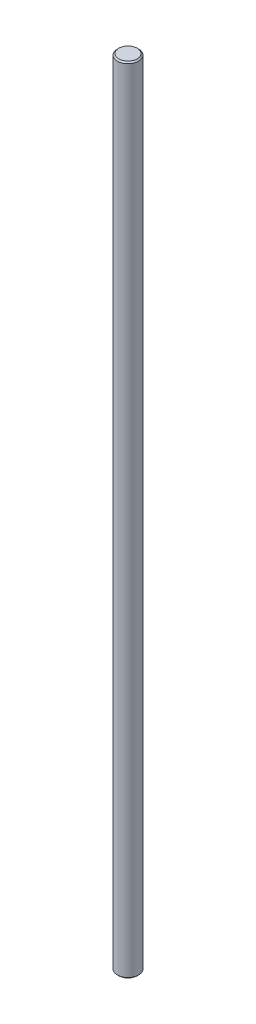
ISO-10303-21;
HEADER;
FILE_DESCRIPTION(('STEP AP214'),'2;1');
FILE_NAME('part.step','',(''),(''),'','','');
FILE_SCHEMA(('AUTOMOTIVE_DESIGN { 1 0 10303 214 1 1 1 1 }'));
ENDSEC;
DATA;
#1=APPLICATION_CONTEXT('core data for automotive mechanical design processes');
#2=APPLICATION_PROTOCOL_DEFINITION('international standard','automotive_design',2000,#1);
#3=PRODUCT_CONTEXT('',#1,'mechanical');
#4=PRODUCT('Part','Part','',(#3));
#5=PRODUCT_RELATED_PRODUCT_CATEGORY('part','',(#4));
#6=PRODUCT_DEFINITION_FORMATION('','',#4);
#7=PRODUCT_DEFINITION_CONTEXT('part definition',#1,'design');
#8=PRODUCT_DEFINITION('design','',#6,#7);
#9=PRODUCT_DEFINITION_SHAPE('','',#8);
#10=(LENGTH_UNIT() NAMED_UNIT(*) SI_UNIT(.MILLI.,.METRE.));
#11=(NAMED_UNIT(*) PLANE_ANGLE_UNIT() SI_UNIT($,.RADIAN.));
#12=(NAMED_UNIT(*) SI_UNIT($,.STERADIAN.) SOLID_ANGLE_UNIT());
#13=UNCERTAINTY_MEASURE_WITH_UNIT(LENGTH_MEASURE(1.E-05),#10,'distance_accuracy_value','');
#14=(GEOMETRIC_REPRESENTATION_CONTEXT(3) GLOBAL_UNCERTAINTY_ASSIGNED_CONTEXT((#13)) GLOBAL_UNIT_ASSIGNED_CONTEXT((#10,
#11,#12)) REPRESENTATION_CONTEXT('',''));
#15=CARTESIAN_POINT('',(0.,0.,0.));
#16=DIRECTION('',(0.,0.,1.));
#17=DIRECTION('',(1.,0.,0.));
#18=AXIS2_PLACEMENT_3D('',#15,#16,#17);
#19=CARTESIAN_POINT('',(0.,300.,0.));
#20=DIRECTION('',(0.,1.,0.));
#21=DIRECTION('',(0.,0.,1.));
#22=AXIS2_PLACEMENT_3D('',#19,#20,#21);
#23=PLANE('',#22);
#24=CARTESIAN_POINT('',(0.,300.000000000011,0.));
#25=DIRECTION('',(0.,-1.,0.));
#26=DIRECTION('',(0.,0.,-1.));
#27=AXIS2_PLACEMENT_3D('',#24,#25,#26);
#28=CIRCLE('',#27,3.48818999998457);
#29=CARTESIAN_POINT('',(0.,300.000000000011,-3.48818999998457));
#30=VERTEX_POINT('',#29);
#31=EDGE_CURVE('E17',#30,#30,#28,.T.);
#32=ORIENTED_EDGE('',*,*,#31,.F.);
#33=EDGE_LOOP('',(#32));
#34=FACE_BOUND('',#33,.T.);
#35=ADVANCED_FACE('F14',(#34),#23,.T.);
#36=CARTESIAN_POINT('',(0.,0.,0.));
#37=DIRECTION('',(0.,1.,0.));
#38=DIRECTION('',(0.,0.,1.));
#39=AXIS2_PLACEMENT_3D('',#36,#37,#38);
#40=PLANE('',#39);
#41=CARTESIAN_POINT('',(0.,0.,0.));
#42=DIRECTION('',(0.,1.,0.));
#43=DIRECTION('',(0.,0.,1.));
#44=AXIS2_PLACEMENT_3D('',#41,#42,#43);
#45=CIRCLE('',#44,3.48818999998457);
#46=CARTESIAN_POINT('',(0.,0.,3.48818999998457));
#47=VERTEX_POINT('',#46);
#48=EDGE_CURVE('E26',#47,#47,#45,.T.);
#49=ORIENTED_EDGE('',*,*,#48,.F.);
#50=EDGE_LOOP('',(#49));
#51=FACE_BOUND('',#50,.T.);
#52=ADVANCED_FACE('F37',(#51),#40,.F.);
#53=CARTESIAN_POINT('',(0.,299.492000000043,0.));
#54=DIRECTION('',(0.,-1.,0.));
#55=DIRECTION('',(0.,0.,-1.));
#56=AXIS2_PLACEMENT_3D('',#53,#54,#55);
#57=CONICAL_SURFACE('',#56,3.99618999989571,0.7853981633415);
#58=CARTESIAN_POINT('',(0.,299.492,0.));
#59=DIRECTION('',(0.,-1.,0.));
#60=DIRECTION('',(0.,0.,-1.));
#61=AXIS2_PLACEMENT_3D('',#58,#59,#60);
#62=CIRCLE('',#61,3.99619);
#63=CARTESIAN_POINT('',(0.,299.492,-3.99619));
#64=VERTEX_POINT('',#63);
#65=EDGE_CURVE('E21',#64,#64,#62,.T.);
#66=ORIENTED_EDGE('',*,*,#65,.F.);
#67=EDGE_LOOP('',(#66));
#68=FACE_BOUND('',#67,.T.);
#69=ORIENTED_EDGE('',*,*,#31,.T.);
#70=EDGE_LOOP('',(#69));
#71=FACE_BOUND('',#70,.T.);
#72=ADVANCED_FACE('F34',(#68,#71),#57,.T.);
#73=CARTESIAN_POINT('',(0.,0.507999999967979,0.));
#74=DIRECTION('',(0.,1.,0.));
#75=DIRECTION('',(0.,0.,1.));
#76=AXIS2_PLACEMENT_3D('',#73,#74,#75);
#77=CONICAL_SURFACE('',#76,3.99618999995255,0.785398163397448);
#78=CARTESIAN_POINT('',(0.,0.508000000000008,0.));
#79=DIRECTION('',(0.,-1.,0.));
#80=DIRECTION('',(0.,0.,-1.));
#81=AXIS2_PLACEMENT_3D('',#78,#79,#80);
#82=CIRCLE('',#81,3.99619);
#83=CARTESIAN_POINT('',(0.,0.508000000000008,-3.99619));
#84=VERTEX_POINT('',#83);
#85=EDGE_CURVE('E10',#84,#84,#82,.F.);
#86=ORIENTED_EDGE('',*,*,#85,.F.);
#87=EDGE_LOOP('',(#86));
#88=FACE_BOUND('',#87,.T.);
#89=ORIENTED_EDGE('',*,*,#48,.T.);
#90=EDGE_LOOP('',(#89));
#91=FACE_BOUND('',#90,.T.);
#92=ADVANCED_FACE('F45',(#88,#91),#77,.T.);
#93=CARTESIAN_POINT('',(0.,300.,0.));
#94=DIRECTION('',(0.,-1.,0.));
#95=DIRECTION('',(0.,0.,-1.));
#96=AXIS2_PLACEMENT_3D('',#93,#94,#95);
#97=CYLINDRICAL_SURFACE('',#96,3.99619);
#98=ORIENTED_EDGE('',*,*,#85,.T.);
#99=EDGE_LOOP('',(#98));
#100=FACE_BOUND('',#99,.T.);
#101=ORIENTED_EDGE('',*,*,#65,.T.);
#102=EDGE_LOOP('',(#101));
#103=FACE_BOUND('',#102,.T.);
#104=ADVANCED_FACE('F43',(#100,#103),#97,.T.);
#105=CLOSED_SHELL('',(#35,#52,#72,#92,#104));
#106=MANIFOLD_SOLID_BREP('B1',#105);
#107=ADVANCED_BREP_SHAPE_REPRESENTATION('',(#18,#106),#14);
#108=SHAPE_DEFINITION_REPRESENTATION(#9,#107);
ENDSEC;
END-ISO-10303-21;
